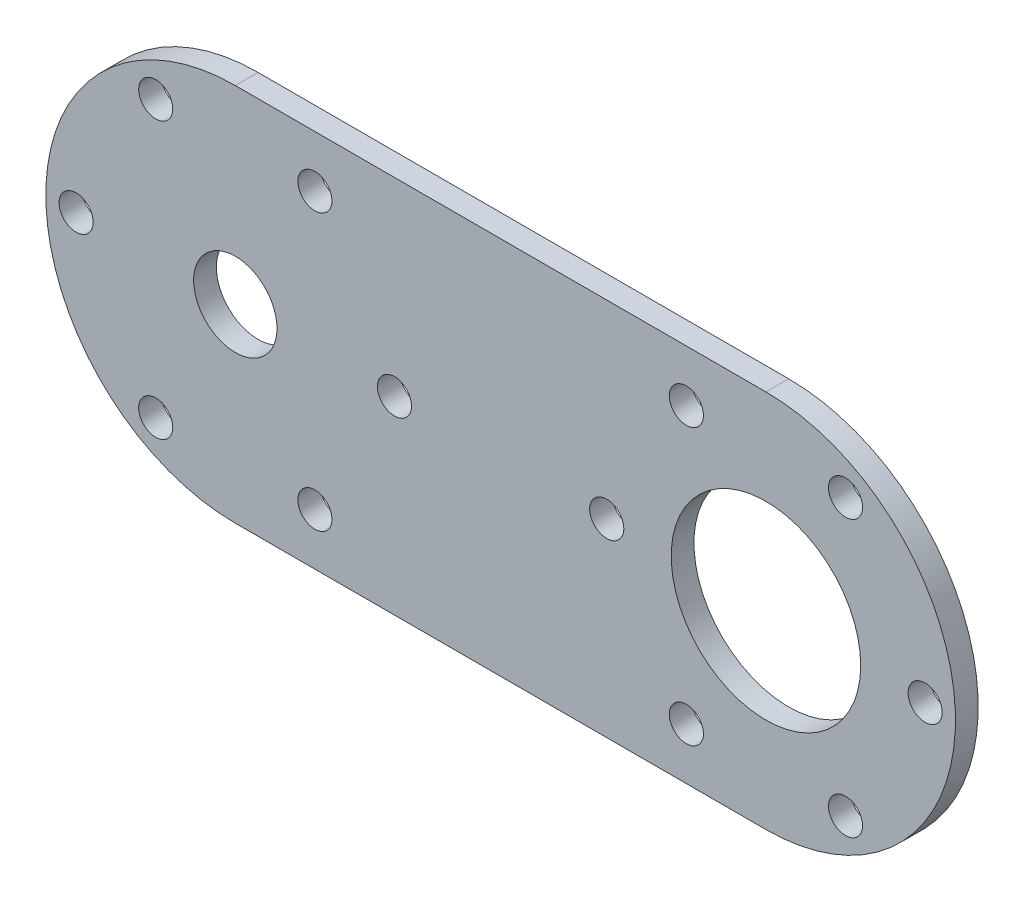
ISO-10303-21;
HEADER;
FILE_DESCRIPTION(('STEP AP214'),'2;1');
FILE_NAME('part.step','',(''),(''),'','','');
FILE_SCHEMA(('AUTOMOTIVE_DESIGN { 1 0 10303 214 1 1 1 1 }'));
ENDSEC;
DATA;
#1=APPLICATION_CONTEXT('core data for automotive mechanical design processes');
#2=APPLICATION_PROTOCOL_DEFINITION('international standard','automotive_design',2000,#1);
#3=PRODUCT_CONTEXT('',#1,'mechanical');
#4=PRODUCT('Part','Part','',(#3));
#5=PRODUCT_RELATED_PRODUCT_CATEGORY('part','',(#4));
#6=PRODUCT_DEFINITION_FORMATION('','',#4);
#7=PRODUCT_DEFINITION_CONTEXT('part definition',#1,'design');
#8=PRODUCT_DEFINITION('design','',#6,#7);
#9=PRODUCT_DEFINITION_SHAPE('','',#8);
#10=(LENGTH_UNIT() NAMED_UNIT(*) SI_UNIT(.MILLI.,.METRE.));
#11=(NAMED_UNIT(*) PLANE_ANGLE_UNIT() SI_UNIT($,.RADIAN.));
#12=(NAMED_UNIT(*) SI_UNIT($,.STERADIAN.) SOLID_ANGLE_UNIT());
#13=UNCERTAINTY_MEASURE_WITH_UNIT(LENGTH_MEASURE(1.E-05),#10,'distance_accuracy_value','');
#14=(GEOMETRIC_REPRESENTATION_CONTEXT(3) GLOBAL_UNCERTAINTY_ASSIGNED_CONTEXT((#13)) GLOBAL_UNIT_ASSIGNED_CONTEXT((#10,
#11,#12)) REPRESENTATION_CONTEXT('',''));
#15=CARTESIAN_POINT('',(0.,0.,0.));
#16=DIRECTION('',(0.,0.,1.));
#17=DIRECTION('',(1.,0.,0.));
#18=AXIS2_PLACEMENT_3D('',#15,#16,#17);
#19=CARTESIAN_POINT('',(0.,-25.,3.));
#20=DIRECTION('',(0.,-1.,0.));
#21=DIRECTION('',(1.,0.,0.));
#22=AXIS2_PLACEMENT_3D('',#19,#20,#21);
#23=PLANE('',#22);
#24=DIRECTION('',(-1.,0.,0.));
#25=VECTOR('',#24,1.);
#26=CARTESIAN_POINT('',(0.,-25.,0.));
#27=LINE('',#26,#25);
#28=CARTESIAN_POINT('',(70.,-25.,0.));
#29=VERTEX_POINT('',#28);
#30=CARTESIAN_POINT('',(0.,-25.,0.));
#31=VERTEX_POINT('',#30);
#32=EDGE_CURVE('E102',#29,#31,#27,.T.);
#33=ORIENTED_EDGE('',*,*,#32,.F.);
#34=DIRECTION('',(0.,0.,-1.));
#35=VECTOR('',#34,1.);
#36=CARTESIAN_POINT('',(70.,-25.,3.));
#37=LINE('',#36,#35);
#38=CARTESIAN_POINT('',(70.,-25.,3.));
#39=VERTEX_POINT('',#38);
#40=EDGE_CURVE('E11',#39,#29,#37,.T.);
#41=ORIENTED_EDGE('',*,*,#40,.F.);
#42=DIRECTION('',(-1.,0.,0.));
#43=VECTOR('',#42,1.);
#44=CARTESIAN_POINT('',(0.,-25.,3.));
#45=LINE('',#44,#43);
#46=CARTESIAN_POINT('',(0.,-25.,3.));
#47=VERTEX_POINT('',#46);
#48=EDGE_CURVE('E84',#39,#47,#45,.T.);
#49=ORIENTED_EDGE('',*,*,#48,.T.);
#50=DIRECTION('',(0.,0.,-1.));
#51=VECTOR('',#50,1.);
#52=CARTESIAN_POINT('',(0.,-25.,3.));
#53=LINE('',#52,#51);
#54=EDGE_CURVE('E73',#47,#31,#53,.T.);
#55=ORIENTED_EDGE('',*,*,#54,.T.);
#56=EDGE_LOOP('',(#33,#41,#49,#55));
#57=FACE_BOUND('',#56,.T.);
#58=ADVANCED_FACE('F35',(#57),#23,.T.);
#59=CARTESIAN_POINT('',(70.,0.,3.));
#60=DIRECTION('',(0.,0.,-1.));
#61=DIRECTION('',(-1.,0.,0.));
#62=AXIS2_PLACEMENT_3D('',#59,#60,#61);
#63=CYLINDRICAL_SURFACE('',#62,25.);
#64=CARTESIAN_POINT('',(70.,0.,0.));
#65=DIRECTION('',(0.,0.,1.));
#66=DIRECTION('',(1.,0.,0.));
#67=AXIS2_PLACEMENT_3D('',#64,#65,#66);
#68=CIRCLE('',#67,25.);
#69=CARTESIAN_POINT('',(70.,25.,0.));
#70=VERTEX_POINT('',#69);
#71=EDGE_CURVE('E90',#29,#70,#68,.T.);
#72=ORIENTED_EDGE('',*,*,#71,.T.);
#73=DIRECTION('',(0.,0.,-1.));
#74=VECTOR('',#73,1.);
#75=CARTESIAN_POINT('',(70.,25.,3.));
#76=LINE('',#75,#74);
#77=CARTESIAN_POINT('',(70.,25.,3.));
#78=VERTEX_POINT('',#77);
#79=EDGE_CURVE('E43',#78,#70,#76,.T.);
#80=ORIENTED_EDGE('',*,*,#79,.F.);
#81=CARTESIAN_POINT('',(70.,0.,3.));
#82=DIRECTION('',(0.,0.,1.));
#83=DIRECTION('',(1.,0.,0.));
#84=AXIS2_PLACEMENT_3D('',#81,#82,#83);
#85=CIRCLE('',#84,25.);
#86=EDGE_CURVE('E78',#39,#78,#85,.T.);
#87=ORIENTED_EDGE('',*,*,#86,.F.);
#88=ORIENTED_EDGE('',*,*,#40,.T.);
#89=EDGE_LOOP('',(#72,#80,#87,#88));
#90=FACE_BOUND('',#89,.T.);
#91=ADVANCED_FACE('F88',(#90),#63,.T.);
#92=CARTESIAN_POINT('',(0.,25.,3.));
#93=DIRECTION('',(0.,1.,0.));
#94=DIRECTION('',(-1.,0.,0.));
#95=AXIS2_PLACEMENT_3D('',#92,#93,#94);
#96=PLANE('',#95);
#97=DIRECTION('',(1.,0.,0.));
#98=VECTOR('',#97,1.);
#99=CARTESIAN_POINT('',(0.,25.,0.));
#100=LINE('',#99,#98);
#101=CARTESIAN_POINT('',(0.,25.,0.));
#102=VERTEX_POINT('',#101);
#103=EDGE_CURVE('E107',#102,#70,#100,.T.);
#104=ORIENTED_EDGE('',*,*,#103,.F.);
#105=DIRECTION('',(0.,0.,-1.));
#106=VECTOR('',#105,1.);
#107=CARTESIAN_POINT('',(0.,25.,3.));
#108=LINE('',#107,#106);
#109=CARTESIAN_POINT('',(0.,25.,3.));
#110=VERTEX_POINT('',#109);
#111=EDGE_CURVE('E66',#110,#102,#108,.T.);
#112=ORIENTED_EDGE('',*,*,#111,.F.);
#113=DIRECTION('',(1.,0.,0.));
#114=VECTOR('',#113,1.);
#115=CARTESIAN_POINT('',(0.,25.,3.));
#116=LINE('',#115,#114);
#117=EDGE_CURVE('E83',#110,#78,#116,.T.);
#118=ORIENTED_EDGE('',*,*,#117,.T.);
#119=ORIENTED_EDGE('',*,*,#79,.T.);
#120=EDGE_LOOP('',(#104,#112,#118,#119));
#121=FACE_BOUND('',#120,.T.);
#122=ADVANCED_FACE('F94',(#121),#96,.T.);
#123=CARTESIAN_POINT('',(0.,0.,3.));
#124=DIRECTION('',(0.,0.,-1.));
#125=DIRECTION('',(-1.,0.,0.));
#126=AXIS2_PLACEMENT_3D('',#123,#124,#125);
#127=CYLINDRICAL_SURFACE('',#126,25.);
#128=CARTESIAN_POINT('',(0.,0.,0.));
#129=DIRECTION('',(0.,0.,1.));
#130=DIRECTION('',(1.,0.,0.));
#131=AXIS2_PLACEMENT_3D('',#128,#129,#130);
#132=CIRCLE('',#131,25.);
#133=EDGE_CURVE('E109',#102,#31,#132,.T.);
#134=ORIENTED_EDGE('',*,*,#133,.T.);
#135=ORIENTED_EDGE('',*,*,#54,.F.);
#136=CARTESIAN_POINT('',(0.,0.,3.));
#137=DIRECTION('',(0.,0.,1.));
#138=DIRECTION('',(1.,0.,0.));
#139=AXIS2_PLACEMENT_3D('',#136,#137,#138);
#140=CIRCLE('',#139,25.);
#141=EDGE_CURVE('E51',#110,#47,#140,.T.);
#142=ORIENTED_EDGE('',*,*,#141,.F.);
#143=ORIENTED_EDGE('',*,*,#111,.T.);
#144=EDGE_LOOP('',(#134,#135,#142,#143));
#145=FACE_BOUND('',#144,.T.);
#146=ADVANCED_FACE('F247',(#145),#127,.T.);
#147=CARTESIAN_POINT('',(70.,0.,3.));
#148=DIRECTION('',(0.,0.,-1.));
#149=DIRECTION('',(-1.,0.,0.));
#150=AXIS2_PLACEMENT_3D('',#147,#148,#149);
#151=CYLINDRICAL_SURFACE('',#150,12.5);
#152=CARTESIAN_POINT('',(70.,0.,3.));
#153=DIRECTION('',(0.,0.,1.));
#154=DIRECTION('',(1.,0.,0.));
#155=AXIS2_PLACEMENT_3D('',#152,#153,#154);
#156=CIRCLE('',#155,12.5);
#157=CARTESIAN_POINT('',(82.5,0.,3.));
#158=VERTEX_POINT('',#157);
#159=EDGE_CURVE('E96',#158,#158,#156,.T.);
#160=ORIENTED_EDGE('',*,*,#159,.T.);
#161=EDGE_LOOP('',(#160));
#162=FACE_BOUND('',#161,.T.);
#163=CARTESIAN_POINT('',(70.,0.,0.));
#164=DIRECTION('',(0.,0.,1.));
#165=DIRECTION('',(1.,0.,0.));
#166=AXIS2_PLACEMENT_3D('',#163,#164,#165);
#167=CIRCLE('',#166,12.5);
#168=CARTESIAN_POINT('',(82.5,0.,0.));
#169=VERTEX_POINT('',#168);
#170=EDGE_CURVE('E111',#169,#169,#167,.T.);
#171=ORIENTED_EDGE('',*,*,#170,.F.);
#172=EDGE_LOOP('',(#171));
#173=FACE_BOUND('',#172,.T.);
#174=ADVANCED_FACE('F201',(#162,#173),#151,.F.);
#175=CARTESIAN_POINT('',(0.,0.,3.));
#176=DIRECTION('',(0.,0.,1.));
#177=DIRECTION('',(1.,0.,0.));
#178=AXIS2_PLACEMENT_3D('',#175,#176,#177);
#179=PLANE('',#178);
#180=CARTESIAN_POINT('',(0.,0.,3.));
#181=DIRECTION('',(0.,0.,1.));
#182=DIRECTION('',(1.,0.,0.));
#183=AXIS2_PLACEMENT_3D('',#180,#181,#182);
#184=CIRCLE('',#183,5.5);
#185=CARTESIAN_POINT('',(5.5,0.,3.));
#186=VERTEX_POINT('',#185);
#187=EDGE_CURVE('E192',#186,#186,#184,.T.);
#188=ORIENTED_EDGE('',*,*,#187,.F.);
#189=EDGE_LOOP('',(#188));
#190=FACE_BOUND('',#189,.T.);
#191=CARTESIAN_POINT('',(-21.,0.,3.));
#192=DIRECTION('',(0.,0.,1.));
#193=DIRECTION('',(1.,0.,0.));
#194=AXIS2_PLACEMENT_3D('',#191,#192,#193);
#195=CIRCLE('',#194,2.25);
#196=CARTESIAN_POINT('',(-18.75,0.,3.));
#197=VERTEX_POINT('',#196);
#198=EDGE_CURVE('E186',#197,#197,#195,.T.);
#199=ORIENTED_EDGE('',*,*,#198,.F.);
#200=EDGE_LOOP('',(#199));
#201=FACE_BOUND('',#200,.T.);
#202=CARTESIAN_POINT('',(91.,0.,3.));
#203=DIRECTION('',(0.,0.,1.));
#204=DIRECTION('',(1.,0.,0.));
#205=AXIS2_PLACEMENT_3D('',#202,#203,#204);
#206=CIRCLE('',#205,2.25);
#207=CARTESIAN_POINT('',(93.25,0.,3.));
#208=VERTEX_POINT('',#207);
#209=EDGE_CURVE('E180',#208,#208,#206,.T.);
#210=ORIENTED_EDGE('',*,*,#209,.F.);
#211=EDGE_LOOP('',(#210));
#212=FACE_BOUND('',#211,.T.);
#213=CARTESIAN_POINT('',(-10.5,18.1865334794732,3.));
#214=DIRECTION('',(0.,0.,1.));
#215=DIRECTION('',(1.,0.,0.));
#216=AXIS2_PLACEMENT_3D('',#213,#214,#215);
#217=CIRCLE('',#216,2.25);
#218=CARTESIAN_POINT('',(-8.24999999999996,18.1865334794732,3.));
#219=VERTEX_POINT('',#218);
#220=EDGE_CURVE('E174',#219,#219,#217,.T.);
#221=ORIENTED_EDGE('',*,*,#220,.F.);
#222=EDGE_LOOP('',(#221));
#223=FACE_BOUND('',#222,.T.);
#224=CARTESIAN_POINT('',(10.5000000000001,18.1865334794732,3.));
#225=DIRECTION('',(0.,0.,1.));
#226=DIRECTION('',(1.,0.,0.));
#227=AXIS2_PLACEMENT_3D('',#224,#225,#226);
#228=CIRCLE('',#227,2.25);
#229=CARTESIAN_POINT('',(12.7500000000001,18.1865334794732,3.));
#230=VERTEX_POINT('',#229);
#231=EDGE_CURVE('E168',#230,#230,#228,.T.);
#232=ORIENTED_EDGE('',*,*,#231,.F.);
#233=EDGE_LOOP('',(#232));
#234=FACE_BOUND('',#233,.T.);
#235=CARTESIAN_POINT('',(21.,-1.46642216231412E-13,3.));
#236=DIRECTION('',(0.,0.,1.));
#237=DIRECTION('',(1.,0.,0.));
#238=AXIS2_PLACEMENT_3D('',#235,#236,#237);
#239=CIRCLE('',#238,2.25);
#240=CARTESIAN_POINT('',(23.25,-1.46642216231412E-13,3.));
#241=VERTEX_POINT('',#240);
#242=EDGE_CURVE('E162',#241,#241,#239,.T.);
#243=ORIENTED_EDGE('',*,*,#242,.F.);
#244=EDGE_LOOP('',(#243));
#245=FACE_BOUND('',#244,.T.);
#246=CARTESIAN_POINT('',(10.4999999999998,-18.1865334794733,3.));
#247=DIRECTION('',(0.,0.,1.));
#248=DIRECTION('',(1.,0.,0.));
#249=AXIS2_PLACEMENT_3D('',#246,#247,#248);
#250=CIRCLE('',#249,2.25);
#251=CARTESIAN_POINT('',(12.7499999999998,-18.1865334794733,3.));
#252=VERTEX_POINT('',#251);
#253=EDGE_CURVE('E156',#252,#252,#250,.T.);
#254=ORIENTED_EDGE('',*,*,#253,.F.);
#255=EDGE_LOOP('',(#254));
#256=FACE_BOUND('',#255,.T.);
#257=CARTESIAN_POINT('',(-10.5000000000002,-18.1865334794731,3.));
#258=DIRECTION('',(0.,0.,1.));
#259=DIRECTION('',(1.,0.,0.));
#260=AXIS2_PLACEMENT_3D('',#257,#258,#259);
#261=CIRCLE('',#260,2.25);
#262=CARTESIAN_POINT('',(-8.25000000000021,-18.1865334794731,3.));
#263=VERTEX_POINT('',#262);
#264=EDGE_CURVE('E150',#263,#263,#261,.T.);
#265=ORIENTED_EDGE('',*,*,#264,.F.);
#266=EDGE_LOOP('',(#265));
#267=FACE_BOUND('',#266,.T.);
#268=CARTESIAN_POINT('',(80.5,-18.1865334794732,3.));
#269=DIRECTION('',(0.,0.,1.));
#270=DIRECTION('',(1.,0.,0.));
#271=AXIS2_PLACEMENT_3D('',#268,#269,#270);
#272=CIRCLE('',#271,2.25);
#273=CARTESIAN_POINT('',(82.75,-18.1865334794732,3.));
#274=VERTEX_POINT('',#273);
#275=EDGE_CURVE('E144',#274,#274,#272,.T.);
#276=ORIENTED_EDGE('',*,*,#275,.F.);
#277=EDGE_LOOP('',(#276));
#278=FACE_BOUND('',#277,.T.);
#279=CARTESIAN_POINT('',(59.4999999999999,-18.1865334794732,3.));
#280=DIRECTION('',(0.,0.,1.));
#281=DIRECTION('',(1.,0.,0.));
#282=AXIS2_PLACEMENT_3D('',#279,#280,#281);
#283=CIRCLE('',#282,2.25);
#284=CARTESIAN_POINT('',(61.7499999999999,-18.1865334794732,3.));
#285=VERTEX_POINT('',#284);
#286=EDGE_CURVE('E138',#285,#285,#283,.T.);
#287=ORIENTED_EDGE('',*,*,#286,.F.);
#288=EDGE_LOOP('',(#287));
#289=FACE_BOUND('',#288,.T.);
#290=CARTESIAN_POINT('',(49.,1.51785732787831E-13,3.));
#291=DIRECTION('',(0.,0.,1.));
#292=DIRECTION('',(1.,0.,0.));
#293=AXIS2_PLACEMENT_3D('',#290,#291,#292);
#294=CIRCLE('',#293,2.25);
#295=CARTESIAN_POINT('',(51.25,1.51785732787831E-13,3.));
#296=VERTEX_POINT('',#295);
#297=EDGE_CURVE('E132',#296,#296,#294,.T.);
#298=ORIENTED_EDGE('',*,*,#297,.F.);
#299=EDGE_LOOP('',(#298));
#300=FACE_BOUND('',#299,.T.);
#301=CARTESIAN_POINT('',(59.5000000000002,18.1865334794733,3.));
#302=DIRECTION('',(0.,0.,1.));
#303=DIRECTION('',(1.,0.,0.));
#304=AXIS2_PLACEMENT_3D('',#301,#302,#303);
#305=CIRCLE('',#304,2.25);
#306=CARTESIAN_POINT('',(61.7500000000002,18.1865334794733,3.));
#307=VERTEX_POINT('',#306);
#308=EDGE_CURVE('E126',#307,#307,#305,.T.);
#309=ORIENTED_EDGE('',*,*,#308,.F.);
#310=EDGE_LOOP('',(#309));
#311=FACE_BOUND('',#310,.T.);
#312=CARTESIAN_POINT('',(80.5000000000002,18.1865334794731,3.));
#313=DIRECTION('',(0.,0.,1.));
#314=DIRECTION('',(1.,0.,0.));
#315=AXIS2_PLACEMENT_3D('',#312,#313,#314);
#316=CIRCLE('',#315,2.25);
#317=CARTESIAN_POINT('',(82.7500000000002,18.1865334794731,3.));
#318=VERTEX_POINT('',#317);
#319=EDGE_CURVE('E120',#318,#318,#316,.T.);
#320=ORIENTED_EDGE('',*,*,#319,.F.);
#321=EDGE_LOOP('',(#320));
#322=FACE_BOUND('',#321,.T.);
#323=ORIENTED_EDGE('',*,*,#48,.F.);
#324=ORIENTED_EDGE('',*,*,#86,.T.);
#325=ORIENTED_EDGE('',*,*,#117,.F.);
#326=ORIENTED_EDGE('',*,*,#141,.T.);
#327=EDGE_LOOP('',(#323,#324,#325,#326));
#328=FACE_BOUND('',#327,.T.);
#329=ORIENTED_EDGE('',*,*,#159,.F.);
#330=EDGE_LOOP('',(#329));
#331=FACE_BOUND('',#330,.T.);
#332=ADVANCED_FACE('F80',(#190,#201,#212,#223,#234,#245,#256,#267,#278,#289,#300,#311,#322,#328,
#331),#179,.T.);
#333=CARTESIAN_POINT('',(0.,0.,0.));
#334=DIRECTION('',(0.,0.,1.));
#335=DIRECTION('',(1.,0.,0.));
#336=AXIS2_PLACEMENT_3D('',#333,#334,#335);
#337=PLANE('',#336);
#338=CARTESIAN_POINT('',(0.,0.,0.));
#339=DIRECTION('',(0.,0.,1.));
#340=DIRECTION('',(1.,0.,0.));
#341=AXIS2_PLACEMENT_3D('',#338,#339,#340);
#342=CIRCLE('',#341,5.5);
#343=CARTESIAN_POINT('',(5.5,0.,0.));
#344=VERTEX_POINT('',#343);
#345=EDGE_CURVE('E189',#344,#344,#342,.T.);
#346=ORIENTED_EDGE('',*,*,#345,.T.);
#347=EDGE_LOOP('',(#346));
#348=FACE_BOUND('',#347,.T.);
#349=CARTESIAN_POINT('',(-21.,0.,0.));
#350=DIRECTION('',(0.,0.,1.));
#351=DIRECTION('',(1.,0.,0.));
#352=AXIS2_PLACEMENT_3D('',#349,#350,#351);
#353=CIRCLE('',#352,2.25);
#354=CARTESIAN_POINT('',(-18.75,0.,0.));
#355=VERTEX_POINT('',#354);
#356=EDGE_CURVE('E183',#355,#355,#353,.T.);
#357=ORIENTED_EDGE('',*,*,#356,.T.);
#358=EDGE_LOOP('',(#357));
#359=FACE_BOUND('',#358,.T.);
#360=CARTESIAN_POINT('',(91.,0.,0.));
#361=DIRECTION('',(0.,0.,1.));
#362=DIRECTION('',(1.,0.,0.));
#363=AXIS2_PLACEMENT_3D('',#360,#361,#362);
#364=CIRCLE('',#363,2.25);
#365=CARTESIAN_POINT('',(93.25,0.,0.));
#366=VERTEX_POINT('',#365);
#367=EDGE_CURVE('E177',#366,#366,#364,.T.);
#368=ORIENTED_EDGE('',*,*,#367,.T.);
#369=EDGE_LOOP('',(#368));
#370=FACE_BOUND('',#369,.T.);
#371=CARTESIAN_POINT('',(-10.5,18.1865334794732,0.));
#372=DIRECTION('',(0.,0.,1.));
#373=DIRECTION('',(1.,0.,0.));
#374=AXIS2_PLACEMENT_3D('',#371,#372,#373);
#375=CIRCLE('',#374,2.25);
#376=CARTESIAN_POINT('',(-8.24999999999996,18.1865334794732,0.));
#377=VERTEX_POINT('',#376);
#378=EDGE_CURVE('E171',#377,#377,#375,.T.);
#379=ORIENTED_EDGE('',*,*,#378,.T.);
#380=EDGE_LOOP('',(#379));
#381=FACE_BOUND('',#380,.T.);
#382=CARTESIAN_POINT('',(10.5000000000001,18.1865334794732,0.));
#383=DIRECTION('',(0.,0.,1.));
#384=DIRECTION('',(1.,0.,0.));
#385=AXIS2_PLACEMENT_3D('',#382,#383,#384);
#386=CIRCLE('',#385,2.25);
#387=CARTESIAN_POINT('',(12.7500000000001,18.1865334794732,0.));
#388=VERTEX_POINT('',#387);
#389=EDGE_CURVE('E165',#388,#388,#386,.T.);
#390=ORIENTED_EDGE('',*,*,#389,.T.);
#391=EDGE_LOOP('',(#390));
#392=FACE_BOUND('',#391,.T.);
#393=CARTESIAN_POINT('',(21.,-1.46642216231412E-13,0.));
#394=DIRECTION('',(0.,0.,1.));
#395=DIRECTION('',(1.,0.,0.));
#396=AXIS2_PLACEMENT_3D('',#393,#394,#395);
#397=CIRCLE('',#396,2.25);
#398=CARTESIAN_POINT('',(23.25,-1.46642216231412E-13,0.));
#399=VERTEX_POINT('',#398);
#400=EDGE_CURVE('E159',#399,#399,#397,.T.);
#401=ORIENTED_EDGE('',*,*,#400,.T.);
#402=EDGE_LOOP('',(#401));
#403=FACE_BOUND('',#402,.T.);
#404=CARTESIAN_POINT('',(10.4999999999998,-18.1865334794733,0.));
#405=DIRECTION('',(0.,0.,1.));
#406=DIRECTION('',(1.,0.,0.));
#407=AXIS2_PLACEMENT_3D('',#404,#405,#406);
#408=CIRCLE('',#407,2.25);
#409=CARTESIAN_POINT('',(12.7499999999998,-18.1865334794733,0.));
#410=VERTEX_POINT('',#409);
#411=EDGE_CURVE('E153',#410,#410,#408,.T.);
#412=ORIENTED_EDGE('',*,*,#411,.T.);
#413=EDGE_LOOP('',(#412));
#414=FACE_BOUND('',#413,.T.);
#415=CARTESIAN_POINT('',(-10.5000000000002,-18.1865334794731,0.));
#416=DIRECTION('',(0.,0.,1.));
#417=DIRECTION('',(1.,0.,0.));
#418=AXIS2_PLACEMENT_3D('',#415,#416,#417);
#419=CIRCLE('',#418,2.25);
#420=CARTESIAN_POINT('',(-8.25000000000021,-18.1865334794731,0.));
#421=VERTEX_POINT('',#420);
#422=EDGE_CURVE('E147',#421,#421,#419,.T.);
#423=ORIENTED_EDGE('',*,*,#422,.T.);
#424=EDGE_LOOP('',(#423));
#425=FACE_BOUND('',#424,.T.);
#426=CARTESIAN_POINT('',(80.5,-18.1865334794732,0.));
#427=DIRECTION('',(0.,0.,1.));
#428=DIRECTION('',(1.,0.,0.));
#429=AXIS2_PLACEMENT_3D('',#426,#427,#428);
#430=CIRCLE('',#429,2.25);
#431=CARTESIAN_POINT('',(82.75,-18.1865334794732,0.));
#432=VERTEX_POINT('',#431);
#433=EDGE_CURVE('E141',#432,#432,#430,.T.);
#434=ORIENTED_EDGE('',*,*,#433,.T.);
#435=EDGE_LOOP('',(#434));
#436=FACE_BOUND('',#435,.T.);
#437=CARTESIAN_POINT('',(59.4999999999999,-18.1865334794732,0.));
#438=DIRECTION('',(0.,0.,1.));
#439=DIRECTION('',(1.,0.,0.));
#440=AXIS2_PLACEMENT_3D('',#437,#438,#439);
#441=CIRCLE('',#440,2.25);
#442=CARTESIAN_POINT('',(61.7499999999999,-18.1865334794732,0.));
#443=VERTEX_POINT('',#442);
#444=EDGE_CURVE('E135',#443,#443,#441,.T.);
#445=ORIENTED_EDGE('',*,*,#444,.T.);
#446=EDGE_LOOP('',(#445));
#447=FACE_BOUND('',#446,.T.);
#448=CARTESIAN_POINT('',(49.,1.51785732787831E-13,0.));
#449=DIRECTION('',(0.,0.,1.));
#450=DIRECTION('',(1.,0.,0.));
#451=AXIS2_PLACEMENT_3D('',#448,#449,#450);
#452=CIRCLE('',#451,2.25);
#453=CARTESIAN_POINT('',(51.25,1.51785732787831E-13,0.));
#454=VERTEX_POINT('',#453);
#455=EDGE_CURVE('E129',#454,#454,#452,.T.);
#456=ORIENTED_EDGE('',*,*,#455,.T.);
#457=EDGE_LOOP('',(#456));
#458=FACE_BOUND('',#457,.T.);
#459=CARTESIAN_POINT('',(59.5000000000002,18.1865334794733,0.));
#460=DIRECTION('',(0.,0.,1.));
#461=DIRECTION('',(1.,0.,0.));
#462=AXIS2_PLACEMENT_3D('',#459,#460,#461);
#463=CIRCLE('',#462,2.25);
#464=CARTESIAN_POINT('',(61.7500000000002,18.1865334794733,0.));
#465=VERTEX_POINT('',#464);
#466=EDGE_CURVE('E123',#465,#465,#463,.T.);
#467=ORIENTED_EDGE('',*,*,#466,.T.);
#468=EDGE_LOOP('',(#467));
#469=FACE_BOUND('',#468,.T.);
#470=CARTESIAN_POINT('',(80.5000000000002,18.1865334794731,0.));
#471=DIRECTION('',(0.,0.,1.));
#472=DIRECTION('',(1.,0.,0.));
#473=AXIS2_PLACEMENT_3D('',#470,#471,#472);
#474=CIRCLE('',#473,2.25);
#475=CARTESIAN_POINT('',(82.7500000000002,18.1865334794731,0.));
#476=VERTEX_POINT('',#475);
#477=EDGE_CURVE('E105',#476,#476,#474,.T.);
#478=ORIENTED_EDGE('',*,*,#477,.T.);
#479=EDGE_LOOP('',(#478));
#480=FACE_BOUND('',#479,.T.);
#481=ORIENTED_EDGE('',*,*,#32,.T.);
#482=ORIENTED_EDGE('',*,*,#133,.F.);
#483=ORIENTED_EDGE('',*,*,#103,.T.);
#484=ORIENTED_EDGE('',*,*,#71,.F.);
#485=EDGE_LOOP('',(#481,#482,#483,#484));
#486=FACE_BOUND('',#485,.T.);
#487=ORIENTED_EDGE('',*,*,#170,.T.);
#488=EDGE_LOOP('',(#487));
#489=FACE_BOUND('',#488,.T.);
#490=ADVANCED_FACE('F200',(#348,#359,#370,#381,#392,#403,#414,#425,#436,#447,#458,#469,#480,
#486,#489),#337,.F.);
#491=CARTESIAN_POINT('',(80.5000000000002,18.1865334794731,3.));
#492=DIRECTION('',(0.,0.,1.));
#493=DIRECTION('',(1.,0.,0.));
#494=AXIS2_PLACEMENT_3D('',#491,#492,#493);
#495=CYLINDRICAL_SURFACE('',#494,2.25);
#496=ORIENTED_EDGE('',*,*,#477,.F.);
#497=EDGE_LOOP('',(#496));
#498=FACE_BOUND('',#497,.T.);
#499=ORIENTED_EDGE('',*,*,#319,.T.);
#500=EDGE_LOOP('',(#499));
#501=FACE_BOUND('',#500,.T.);
#502=ADVANCED_FACE('F227',(#498,#501),#495,.F.);
#503=CARTESIAN_POINT('',(59.5000000000002,18.1865334794733,3.));
#504=DIRECTION('',(0.,0.,1.));
#505=DIRECTION('',(1.,0.,0.));
#506=AXIS2_PLACEMENT_3D('',#503,#504,#505);
#507=CYLINDRICAL_SURFACE('',#506,2.25);
#508=ORIENTED_EDGE('',*,*,#466,.F.);
#509=EDGE_LOOP('',(#508));
#510=FACE_BOUND('',#509,.T.);
#511=ORIENTED_EDGE('',*,*,#308,.T.);
#512=EDGE_LOOP('',(#511));
#513=FACE_BOUND('',#512,.T.);
#514=ADVANCED_FACE('F229',(#510,#513),#507,.F.);
#515=CARTESIAN_POINT('',(49.,1.51785732787831E-13,3.));
#516=DIRECTION('',(0.,0.,1.));
#517=DIRECTION('',(1.,0.,0.));
#518=AXIS2_PLACEMENT_3D('',#515,#516,#517);
#519=CYLINDRICAL_SURFACE('',#518,2.25);
#520=ORIENTED_EDGE('',*,*,#455,.F.);
#521=EDGE_LOOP('',(#520));
#522=FACE_BOUND('',#521,.T.);
#523=ORIENTED_EDGE('',*,*,#297,.T.);
#524=EDGE_LOOP('',(#523));
#525=FACE_BOUND('',#524,.T.);
#526=ADVANCED_FACE('F236',(#522,#525),#519,.F.);
#527=CARTESIAN_POINT('',(59.4999999999999,-18.1865334794732,3.));
#528=DIRECTION('',(0.,0.,1.));
#529=DIRECTION('',(1.,0.,0.));
#530=AXIS2_PLACEMENT_3D('',#527,#528,#529);
#531=CYLINDRICAL_SURFACE('',#530,2.25);
#532=ORIENTED_EDGE('',*,*,#444,.F.);
#533=EDGE_LOOP('',(#532));
#534=FACE_BOUND('',#533,.T.);
#535=ORIENTED_EDGE('',*,*,#286,.T.);
#536=EDGE_LOOP('',(#535));
#537=FACE_BOUND('',#536,.T.);
#538=ADVANCED_FACE('F327',(#534,#537),#531,.F.);
#539=CARTESIAN_POINT('',(80.5,-18.1865334794732,3.));
#540=DIRECTION('',(0.,0.,1.));
#541=DIRECTION('',(1.,0.,0.));
#542=AXIS2_PLACEMENT_3D('',#539,#540,#541);
#543=CYLINDRICAL_SURFACE('',#542,2.25);
#544=ORIENTED_EDGE('',*,*,#433,.F.);
#545=EDGE_LOOP('',(#544));
#546=FACE_BOUND('',#545,.T.);
#547=ORIENTED_EDGE('',*,*,#275,.T.);
#548=EDGE_LOOP('',(#547));
#549=FACE_BOUND('',#548,.T.);
#550=ADVANCED_FACE('F336',(#546,#549),#543,.F.);
#551=CARTESIAN_POINT('',(-10.5000000000002,-18.1865334794731,3.));
#552=DIRECTION('',(0.,0.,1.));
#553=DIRECTION('',(1.,0.,0.));
#554=AXIS2_PLACEMENT_3D('',#551,#552,#553);
#555=CYLINDRICAL_SURFACE('',#554,2.25);
#556=ORIENTED_EDGE('',*,*,#422,.F.);
#557=EDGE_LOOP('',(#556));
#558=FACE_BOUND('',#557,.T.);
#559=ORIENTED_EDGE('',*,*,#264,.T.);
#560=EDGE_LOOP('',(#559));
#561=FACE_BOUND('',#560,.T.);
#562=ADVANCED_FACE('F345',(#558,#561),#555,.F.);
#563=CARTESIAN_POINT('',(10.4999999999998,-18.1865334794733,3.));
#564=DIRECTION('',(0.,0.,1.));
#565=DIRECTION('',(1.,0.,0.));
#566=AXIS2_PLACEMENT_3D('',#563,#564,#565);
#567=CYLINDRICAL_SURFACE('',#566,2.25);
#568=ORIENTED_EDGE('',*,*,#411,.F.);
#569=EDGE_LOOP('',(#568));
#570=FACE_BOUND('',#569,.T.);
#571=ORIENTED_EDGE('',*,*,#253,.T.);
#572=EDGE_LOOP('',(#571));
#573=FACE_BOUND('',#572,.T.);
#574=ADVANCED_FACE('F354',(#570,#573),#567,.F.);
#575=CARTESIAN_POINT('',(21.,-1.46642216231412E-13,3.));
#576=DIRECTION('',(0.,0.,1.));
#577=DIRECTION('',(1.,0.,0.));
#578=AXIS2_PLACEMENT_3D('',#575,#576,#577);
#579=CYLINDRICAL_SURFACE('',#578,2.25);
#580=ORIENTED_EDGE('',*,*,#400,.F.);
#581=EDGE_LOOP('',(#580));
#582=FACE_BOUND('',#581,.T.);
#583=ORIENTED_EDGE('',*,*,#242,.T.);
#584=EDGE_LOOP('',(#583));
#585=FACE_BOUND('',#584,.T.);
#586=ADVANCED_FACE('F363',(#582,#585),#579,.F.);
#587=CARTESIAN_POINT('',(10.5000000000001,18.1865334794732,3.));
#588=DIRECTION('',(0.,0.,1.));
#589=DIRECTION('',(1.,0.,0.));
#590=AXIS2_PLACEMENT_3D('',#587,#588,#589);
#591=CYLINDRICAL_SURFACE('',#590,2.25);
#592=ORIENTED_EDGE('',*,*,#389,.F.);
#593=EDGE_LOOP('',(#592));
#594=FACE_BOUND('',#593,.T.);
#595=ORIENTED_EDGE('',*,*,#231,.T.);
#596=EDGE_LOOP('',(#595));
#597=FACE_BOUND('',#596,.T.);
#598=ADVANCED_FACE('F372',(#594,#597),#591,.F.);
#599=CARTESIAN_POINT('',(-10.5,18.1865334794732,3.));
#600=DIRECTION('',(0.,0.,1.));
#601=DIRECTION('',(1.,0.,0.));
#602=AXIS2_PLACEMENT_3D('',#599,#600,#601);
#603=CYLINDRICAL_SURFACE('',#602,2.25);
#604=ORIENTED_EDGE('',*,*,#378,.F.);
#605=EDGE_LOOP('',(#604));
#606=FACE_BOUND('',#605,.T.);
#607=ORIENTED_EDGE('',*,*,#220,.T.);
#608=EDGE_LOOP('',(#607));
#609=FACE_BOUND('',#608,.T.);
#610=ADVANCED_FACE('F381',(#606,#609),#603,.F.);
#611=CARTESIAN_POINT('',(91.,0.,3.));
#612=DIRECTION('',(0.,0.,1.));
#613=DIRECTION('',(1.,0.,0.));
#614=AXIS2_PLACEMENT_3D('',#611,#612,#613);
#615=CYLINDRICAL_SURFACE('',#614,2.25);
#616=ORIENTED_EDGE('',*,*,#367,.F.);
#617=EDGE_LOOP('',(#616));
#618=FACE_BOUND('',#617,.T.);
#619=ORIENTED_EDGE('',*,*,#209,.T.);
#620=EDGE_LOOP('',(#619));
#621=FACE_BOUND('',#620,.T.);
#622=ADVANCED_FACE('F390',(#618,#621),#615,.F.);
#623=CARTESIAN_POINT('',(-21.,0.,3.));
#624=DIRECTION('',(0.,0.,1.));
#625=DIRECTION('',(1.,0.,0.));
#626=AXIS2_PLACEMENT_3D('',#623,#624,#625);
#627=CYLINDRICAL_SURFACE('',#626,2.25);
#628=ORIENTED_EDGE('',*,*,#356,.F.);
#629=EDGE_LOOP('',(#628));
#630=FACE_BOUND('',#629,.T.);
#631=ORIENTED_EDGE('',*,*,#198,.T.);
#632=EDGE_LOOP('',(#631));
#633=FACE_BOUND('',#632,.T.);
#634=ADVANCED_FACE('F399',(#630,#633),#627,.F.);
#635=CARTESIAN_POINT('',(0.,0.,3.));
#636=DIRECTION('',(0.,0.,1.));
#637=DIRECTION('',(1.,0.,0.));
#638=AXIS2_PLACEMENT_3D('',#635,#636,#637);
#639=CYLINDRICAL_SURFACE('',#638,5.5);
#640=ORIENTED_EDGE('',*,*,#345,.F.);
#641=EDGE_LOOP('',(#640));
#642=FACE_BOUND('',#641,.T.);
#643=ORIENTED_EDGE('',*,*,#187,.T.);
#644=EDGE_LOOP('',(#643));
#645=FACE_BOUND('',#644,.T.);
#646=ADVANCED_FACE('F196',(#642,#645),#639,.F.);
#647=CLOSED_SHELL('',(#58,#91,#122,#146,#174,#332,#490,#502,#514,#526,#538,#550,#562,#574,#586,
#598,#610,#622,#634,#646));
#648=MANIFOLD_SOLID_BREP('B2',#647);
#649=ADVANCED_BREP_SHAPE_REPRESENTATION('',(#18,#648),#14);
#650=SHAPE_DEFINITION_REPRESENTATION(#9,#649);
ENDSEC;
END-ISO-10303-21;
